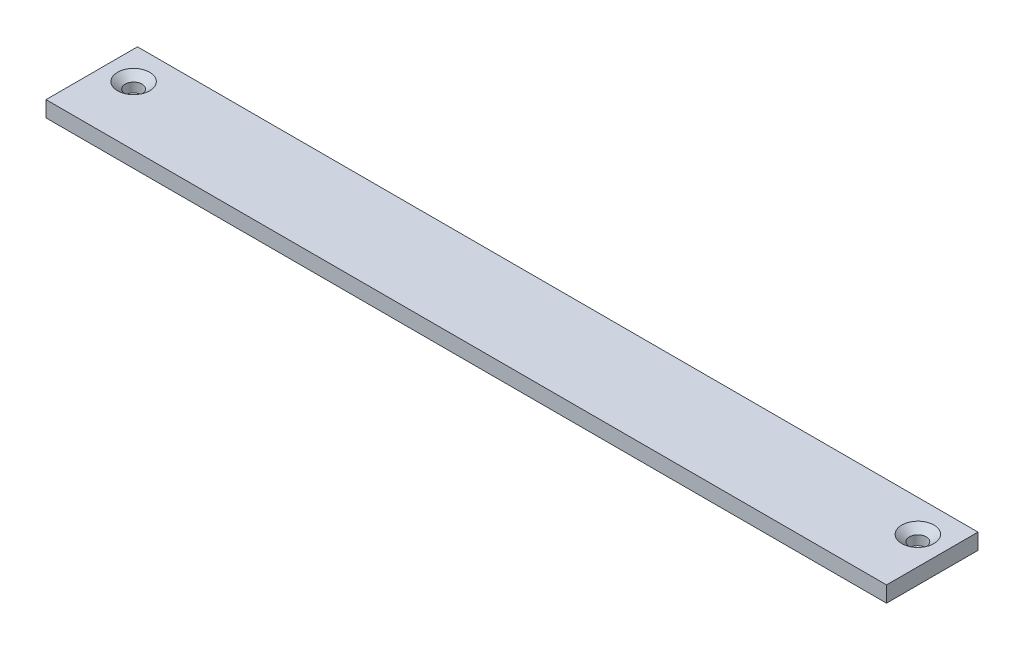
ISO-10303-21;
HEADER;
FILE_DESCRIPTION(('STEP AP214'),'2;1');
FILE_NAME('part.step','',(''),(''),'','','');
FILE_SCHEMA(('AUTOMOTIVE_DESIGN { 1 0 10303 214 1 1 1 1 }'));
ENDSEC;
DATA;
#1=APPLICATION_CONTEXT('core data for automotive mechanical design processes');
#2=APPLICATION_PROTOCOL_DEFINITION('international standard','automotive_design',2000,#1);
#3=PRODUCT_CONTEXT('',#1,'mechanical');
#4=PRODUCT('Part','Part','',(#3));
#5=PRODUCT_RELATED_PRODUCT_CATEGORY('part','',(#4));
#6=PRODUCT_DEFINITION_FORMATION('','',#4);
#7=PRODUCT_DEFINITION_CONTEXT('part definition',#1,'design');
#8=PRODUCT_DEFINITION('design','',#6,#7);
#9=PRODUCT_DEFINITION_SHAPE('','',#8);
#10=(LENGTH_UNIT() NAMED_UNIT(*) SI_UNIT(.MILLI.,.METRE.));
#11=(NAMED_UNIT(*) PLANE_ANGLE_UNIT() SI_UNIT($,.RADIAN.));
#12=(NAMED_UNIT(*) SI_UNIT($,.STERADIAN.) SOLID_ANGLE_UNIT());
#13=UNCERTAINTY_MEASURE_WITH_UNIT(LENGTH_MEASURE(1.E-05),#10,'distance_accuracy_value','');
#14=(GEOMETRIC_REPRESENTATION_CONTEXT(3) GLOBAL_UNCERTAINTY_ASSIGNED_CONTEXT((#13)) GLOBAL_UNIT_ASSIGNED_CONTEXT((#10,
#11,#12)) REPRESENTATION_CONTEXT('',''));
#15=CARTESIAN_POINT('',(0.,0.,0.));
#16=DIRECTION('',(0.,0.,1.));
#17=DIRECTION('',(1.,0.,0.));
#18=AXIS2_PLACEMENT_3D('',#15,#16,#17);
#19=CARTESIAN_POINT('',(168.275,3.175,-23.8125));
#20=DIRECTION('',(-1.,0.,0.));
#21=DIRECTION('',(0.,0.,1.));
#22=AXIS2_PLACEMENT_3D('',#19,#20,#21);
#23=PLANE('',#22);
#24=DIRECTION('',(0.,0.,-1.));
#25=VECTOR('',#24,1.);
#26=CARTESIAN_POINT('',(168.275,-3.175,-23.8125));
#27=LINE('',#26,#25);
#28=CARTESIAN_POINT('',(168.275,-3.175,23.8125));
#29=VERTEX_POINT('',#28);
#30=CARTESIAN_POINT('',(168.275,-3.175,-12.8139773719378));
#31=VERTEX_POINT('',#30);
#32=EDGE_CURVE('E85',#29,#31,#27,.T.);
#33=ORIENTED_EDGE('',*,*,#32,.T.);
#34=DIRECTION('',(0.,1.,0.));
#35=VECTOR('',#34,1.);
#36=CARTESIAN_POINT('',(168.275,3.175,-12.8139773719378));
#37=LINE('',#36,#35);
#38=CARTESIAN_POINT('',(168.275,3.175,-12.8139773719378));
#39=VERTEX_POINT('',#38);
#40=EDGE_CURVE('E51',#31,#39,#37,.T.);
#41=ORIENTED_EDGE('',*,*,#40,.T.);
#42=DIRECTION('',(0.,0.,-1.));
#43=VECTOR('',#42,1.);
#44=CARTESIAN_POINT('',(168.275,3.175,-23.8125));
#45=LINE('',#44,#43);
#46=CARTESIAN_POINT('',(168.275,3.175,23.8125));
#47=VERTEX_POINT('',#46);
#48=EDGE_CURVE('E80',#47,#39,#45,.T.);
#49=ORIENTED_EDGE('',*,*,#48,.F.);
#50=DIRECTION('',(0.,-1.,0.));
#51=VECTOR('',#50,1.);
#52=CARTESIAN_POINT('',(168.275,3.175,23.8125));
#53=LINE('',#52,#51);
#54=EDGE_CURVE('E44',#47,#29,#53,.T.);
#55=ORIENTED_EDGE('',*,*,#54,.T.);
#56=EDGE_LOOP('',(#33,#41,#49,#55));
#57=FACE_BOUND('',#56,.T.);
#58=ADVANCED_FACE('F37',(#57),#23,.F.);
#59=CARTESIAN_POINT('',(-168.275,3.175,-23.8125));
#60=DIRECTION('',(1.,0.,0.));
#61=DIRECTION('',(0.,0.,-1.));
#62=AXIS2_PLACEMENT_3D('',#59,#60,#61);
#63=PLANE('',#62);
#64=DIRECTION('',(0.,0.,1.));
#65=VECTOR('',#64,1.);
#66=CARTESIAN_POINT('',(-168.275,3.175,-23.8125));
#67=LINE('',#66,#65);
#68=CARTESIAN_POINT('',(-168.275,3.175,-12.8139773719378));
#69=VERTEX_POINT('',#68);
#70=CARTESIAN_POINT('',(-168.275,3.175,23.8125));
#71=VERTEX_POINT('',#70);
#72=EDGE_CURVE('E96',#69,#71,#67,.T.);
#73=ORIENTED_EDGE('',*,*,#72,.F.);
#74=DIRECTION('',(0.,-1.,0.));
#75=VECTOR('',#74,1.);
#76=CARTESIAN_POINT('',(-168.275,3.175,-12.8139773719378));
#77=LINE('',#76,#75);
#78=CARTESIAN_POINT('',(-168.275,-3.175,-12.8139773719378));
#79=VERTEX_POINT('',#78);
#80=EDGE_CURVE('E113',#69,#79,#77,.T.);
#81=ORIENTED_EDGE('',*,*,#80,.T.);
#82=DIRECTION('',(0.,0.,1.));
#83=VECTOR('',#82,1.);
#84=CARTESIAN_POINT('',(-168.275,-3.175,-23.8125));
#85=LINE('',#84,#83);
#86=CARTESIAN_POINT('',(-168.275,-3.175,23.8125));
#87=VERTEX_POINT('',#86);
#88=EDGE_CURVE('E81',#79,#87,#85,.T.);
#89=ORIENTED_EDGE('',*,*,#88,.T.);
#90=DIRECTION('',(0.,-1.,0.));
#91=VECTOR('',#90,1.);
#92=CARTESIAN_POINT('',(-168.275,3.175,23.8125));
#93=LINE('',#92,#91);
#94=EDGE_CURVE('E11',#71,#87,#93,.T.);
#95=ORIENTED_EDGE('',*,*,#94,.F.);
#96=EDGE_LOOP('',(#73,#81,#89,#95));
#97=FACE_BOUND('',#96,.T.);
#98=ADVANCED_FACE('F129',(#97),#63,.F.);
#99=CARTESIAN_POINT('',(-168.275,3.175,23.8125));
#100=DIRECTION('',(0.,0.,-1.));
#101=DIRECTION('',(-1.,0.,0.));
#102=AXIS2_PLACEMENT_3D('',#99,#100,#101);
#103=PLANE('',#102);
#104=DIRECTION('',(1.,0.,0.));
#105=VECTOR('',#104,1.);
#106=CARTESIAN_POINT('',(-168.275,-3.175,23.8125));
#107=LINE('',#106,#105);
#108=EDGE_CURVE('E72',#87,#29,#107,.T.);
#109=ORIENTED_EDGE('',*,*,#108,.T.);
#110=ORIENTED_EDGE('',*,*,#54,.F.);
#111=DIRECTION('',(1.,0.,0.));
#112=VECTOR('',#111,1.);
#113=CARTESIAN_POINT('',(-168.275,3.175,23.8125));
#114=LINE('',#113,#112);
#115=EDGE_CURVE('E60',#71,#47,#114,.T.);
#116=ORIENTED_EDGE('',*,*,#115,.F.);
#117=ORIENTED_EDGE('',*,*,#94,.T.);
#118=EDGE_LOOP('',(#109,#110,#116,#117));
#119=FACE_BOUND('',#118,.T.);
#120=ADVANCED_FACE('F74',(#119),#103,.F.);
#121=CARTESIAN_POINT('',(0.,3.175,0.));
#122=DIRECTION('',(0.,1.,0.));
#123=DIRECTION('',(0.,0.,1.));
#124=AXIS2_PLACEMENT_3D('',#121,#122,#123);
#125=PLANE('',#124);
#126=DIRECTION('',(-1.,0.,0.));
#127=VECTOR('',#126,1.);
#128=CARTESIAN_POINT('',(168.275,3.175,-12.8139773719378));
#129=LINE('',#128,#127);
#130=EDGE_CURVE('E116',#39,#69,#129,.T.);
#131=ORIENTED_EDGE('',*,*,#130,.T.);
#132=ORIENTED_EDGE('',*,*,#72,.T.);
#133=ORIENTED_EDGE('',*,*,#115,.T.);
#134=ORIENTED_EDGE('',*,*,#48,.T.);
#135=EDGE_LOOP('',(#131,#132,#133,#134));
#136=FACE_BOUND('',#135,.T.);
#137=CARTESIAN_POINT('',(-157.00375,3.175,0.));
#138=DIRECTION('',(0.,1.,0.));
#139=DIRECTION('',(0.,0.,1.));
#140=AXIS2_PLACEMENT_3D('',#137,#138,#139);
#141=CIRCLE('',#140,6.4389);
#142=CARTESIAN_POINT('',(-157.00375,3.175,6.4389));
#143=VERTEX_POINT('',#142);
#144=EDGE_CURVE('E110',#143,#143,#141,.T.);
#145=ORIENTED_EDGE('',*,*,#144,.F.);
#146=EDGE_LOOP('',(#145));
#147=FACE_BOUND('',#146,.T.);
#148=CARTESIAN_POINT('',(157.00375,3.175,0.));
#149=DIRECTION('',(0.,1.,0.));
#150=DIRECTION('',(0.,0.,1.));
#151=AXIS2_PLACEMENT_3D('',#148,#149,#150);
#152=CIRCLE('',#151,6.4389);
#153=CARTESIAN_POINT('',(157.00375,3.175,6.43889999999996));
#154=VERTEX_POINT('',#153);
#155=EDGE_CURVE('E101',#154,#154,#152,.T.);
#156=ORIENTED_EDGE('',*,*,#155,.F.);
#157=EDGE_LOOP('',(#156));
#158=FACE_BOUND('',#157,.T.);
#159=ADVANCED_FACE('F123',(#136,#147,#158),#125,.T.);
#160=CARTESIAN_POINT('',(0.,-3.175,0.));
#161=DIRECTION('',(0.,1.,0.));
#162=DIRECTION('',(0.,0.,1.));
#163=AXIS2_PLACEMENT_3D('',#160,#161,#162);
#164=PLANE('',#163);
#165=CARTESIAN_POINT('',(-157.00375,-3.175,0.));
#166=DIRECTION('',(0.,1.,0.));
#167=DIRECTION('',(0.,0.,1.));
#168=AXIS2_PLACEMENT_3D('',#165,#166,#167);
#169=CIRCLE('',#168,3.3782);
#170=CARTESIAN_POINT('',(-157.00375,-3.175,3.3782));
#171=VERTEX_POINT('',#170);
#172=EDGE_CURVE('E104',#171,#171,#169,.T.);
#173=ORIENTED_EDGE('',*,*,#172,.T.);
#174=EDGE_LOOP('',(#173));
#175=FACE_BOUND('',#174,.T.);
#176=CARTESIAN_POINT('',(157.00375,-3.175,0.));
#177=DIRECTION('',(0.,1.,0.));
#178=DIRECTION('',(0.,0.,1.));
#179=AXIS2_PLACEMENT_3D('',#176,#177,#178);
#180=CIRCLE('',#179,3.3782);
#181=CARTESIAN_POINT('',(157.00375,-3.175,3.37819999999996));
#182=VERTEX_POINT('',#181);
#183=EDGE_CURVE('E88',#182,#182,#180,.T.);
#184=ORIENTED_EDGE('',*,*,#183,.T.);
#185=EDGE_LOOP('',(#184));
#186=FACE_BOUND('',#185,.T.);
#187=ORIENTED_EDGE('',*,*,#88,.F.);
#188=DIRECTION('',(-1.,0.,0.));
#189=VECTOR('',#188,1.);
#190=CARTESIAN_POINT('',(168.275,-3.175,-12.8139773719378));
#191=LINE('',#190,#189);
#192=EDGE_CURVE('E87',#31,#79,#191,.T.);
#193=ORIENTED_EDGE('',*,*,#192,.F.);
#194=ORIENTED_EDGE('',*,*,#32,.F.);
#195=ORIENTED_EDGE('',*,*,#108,.F.);
#196=EDGE_LOOP('',(#187,#193,#194,#195));
#197=FACE_BOUND('',#196,.T.);
#198=ADVANCED_FACE('F86',(#175,#186,#197),#164,.F.);
#199=CARTESIAN_POINT('',(157.00375,3.175,0.));
#200=DIRECTION('',(0.,1.,0.));
#201=DIRECTION('',(0.,0.,1.));
#202=AXIS2_PLACEMENT_3D('',#199,#200,#201);
#203=CYLINDRICAL_SURFACE('',#202,3.3782);
#204=ORIENTED_EDGE('',*,*,#183,.F.);
#205=EDGE_LOOP('',(#204));
#206=FACE_BOUND('',#205,.T.);
#207=CARTESIAN_POINT('',(157.00375,0.606767758855699,0.));
#208=DIRECTION('',(0.,1.,0.));
#209=DIRECTION('',(0.,0.,1.));
#210=AXIS2_PLACEMENT_3D('',#207,#208,#209);
#211=CIRCLE('',#210,3.3782);
#212=CARTESIAN_POINT('',(157.00375,0.606767758855699,3.37819999999996));
#213=VERTEX_POINT('',#212);
#214=EDGE_CURVE('E92',#213,#213,#211,.T.);
#215=ORIENTED_EDGE('',*,*,#214,.T.);
#216=EDGE_LOOP('',(#215));
#217=FACE_BOUND('',#216,.T.);
#218=ADVANCED_FACE('F151',(#206,#217),#203,.F.);
#219=CARTESIAN_POINT('',(157.00375,3.175,0.));
#220=DIRECTION('',(0.,1.,0.));
#221=DIRECTION('',(0.,0.,1.));
#222=AXIS2_PLACEMENT_3D('',#219,#220,#221);
#223=CONICAL_SURFACE('',#222,6.4389,0.872664625997165);
#224=ORIENTED_EDGE('',*,*,#214,.F.);
#225=EDGE_LOOP('',(#224));
#226=FACE_BOUND('',#225,.T.);
#227=ORIENTED_EDGE('',*,*,#155,.T.);
#228=EDGE_LOOP('',(#227));
#229=FACE_BOUND('',#228,.T.);
#230=ADVANCED_FACE('F157',(#226,#229),#223,.F.);
#231=CARTESIAN_POINT('',(-157.00375,3.175,0.));
#232=DIRECTION('',(0.,1.,0.));
#233=DIRECTION('',(0.,0.,1.));
#234=AXIS2_PLACEMENT_3D('',#231,#232,#233);
#235=CYLINDRICAL_SURFACE('',#234,3.3782);
#236=ORIENTED_EDGE('',*,*,#172,.F.);
#237=EDGE_LOOP('',(#236));
#238=FACE_BOUND('',#237,.T.);
#239=CARTESIAN_POINT('',(-157.00375,0.606767758855699,0.));
#240=DIRECTION('',(0.,1.,0.));
#241=DIRECTION('',(0.,0.,1.));
#242=AXIS2_PLACEMENT_3D('',#239,#240,#241);
#243=CIRCLE('',#242,3.3782);
#244=CARTESIAN_POINT('',(-157.00375,0.606767758855699,3.3782));
#245=VERTEX_POINT('',#244);
#246=EDGE_CURVE('E107',#245,#245,#243,.T.);
#247=ORIENTED_EDGE('',*,*,#246,.T.);
#248=EDGE_LOOP('',(#247));
#249=FACE_BOUND('',#248,.T.);
#250=ADVANCED_FACE('F137',(#238,#249),#235,.F.);
#251=CARTESIAN_POINT('',(-157.00375,3.175,0.));
#252=DIRECTION('',(0.,1.,0.));
#253=DIRECTION('',(0.,0.,1.));
#254=AXIS2_PLACEMENT_3D('',#251,#252,#253);
#255=CONICAL_SURFACE('',#254,6.4389,0.872664625997165);
#256=ORIENTED_EDGE('',*,*,#246,.F.);
#257=EDGE_LOOP('',(#256));
#258=FACE_BOUND('',#257,.T.);
#259=ORIENTED_EDGE('',*,*,#144,.T.);
#260=EDGE_LOOP('',(#259));
#261=FACE_BOUND('',#260,.T.);
#262=ADVANCED_FACE('F132',(#258,#261),#255,.F.);
#263=CARTESIAN_POINT('',(168.275,3.175,-12.8139773719378));
#264=DIRECTION('',(0.,0.,1.));
#265=DIRECTION('',(1.,0.,0.));
#266=AXIS2_PLACEMENT_3D('',#263,#264,#265);
#267=PLANE('',#266);
#268=ORIENTED_EDGE('',*,*,#130,.F.);
#269=ORIENTED_EDGE('',*,*,#40,.F.);
#270=ORIENTED_EDGE('',*,*,#192,.T.);
#271=ORIENTED_EDGE('',*,*,#80,.F.);
#272=EDGE_LOOP('',(#268,#269,#270,#271));
#273=FACE_BOUND('',#272,.T.);
#274=ADVANCED_FACE('F130',(#273),#267,.F.);
#275=CLOSED_SHELL('',(#58,#98,#120,#159,#198,#218,#230,#250,#262,#274));
#276=MANIFOLD_SOLID_BREP('B2',#275);
#277=ADVANCED_BREP_SHAPE_REPRESENTATION('',(#18,#276),#14);
#278=SHAPE_DEFINITION_REPRESENTATION(#9,#277);
ENDSEC;
END-ISO-10303-21;
